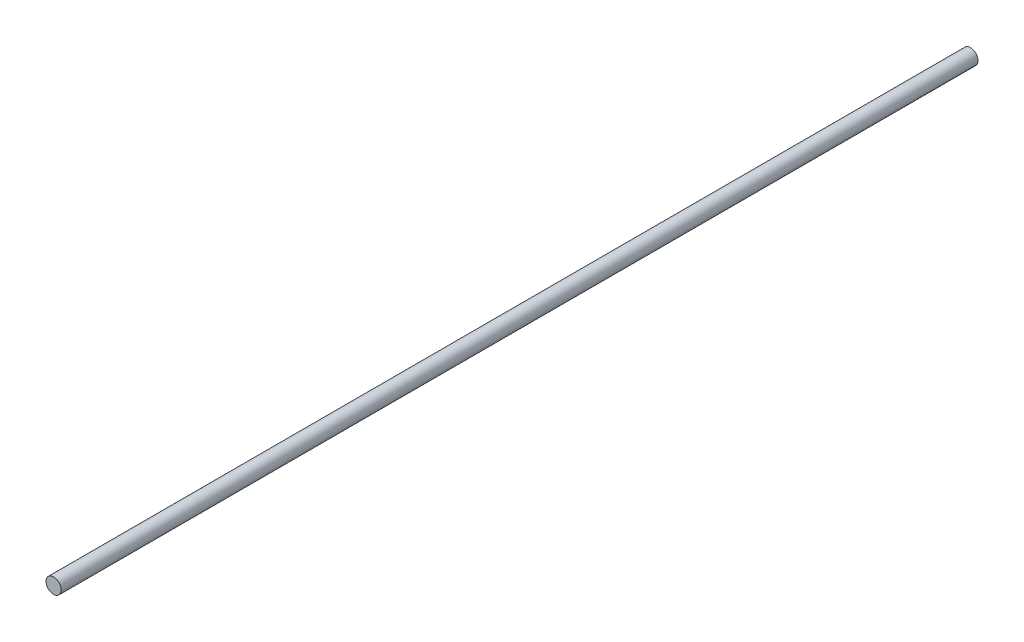
ISO-10303-21;
HEADER;
FILE_DESCRIPTION(('STEP AP214'),'2;1');
FILE_NAME('part.step','',(''),(''),'','','');
FILE_SCHEMA(('AUTOMOTIVE_DESIGN { 1 0 10303 214 1 1 1 1 }'));
ENDSEC;
DATA;
#1=APPLICATION_CONTEXT('core data for automotive mechanical design processes');
#2=APPLICATION_PROTOCOL_DEFINITION('international standard','automotive_design',2000,#1);
#3=PRODUCT_CONTEXT('',#1,'mechanical');
#4=PRODUCT('Part','Part','',(#3));
#5=PRODUCT_RELATED_PRODUCT_CATEGORY('part','',(#4));
#6=PRODUCT_DEFINITION_FORMATION('','',#4);
#7=PRODUCT_DEFINITION_CONTEXT('part definition',#1,'design');
#8=PRODUCT_DEFINITION('design','',#6,#7);
#9=PRODUCT_DEFINITION_SHAPE('','',#8);
#10=(LENGTH_UNIT() NAMED_UNIT(*) SI_UNIT(.MILLI.,.METRE.));
#11=(NAMED_UNIT(*) PLANE_ANGLE_UNIT() SI_UNIT($,.RADIAN.));
#12=(NAMED_UNIT(*) SI_UNIT($,.STERADIAN.) SOLID_ANGLE_UNIT());
#13=UNCERTAINTY_MEASURE_WITH_UNIT(LENGTH_MEASURE(1.E-05),#10,'distance_accuracy_value','');
#14=(GEOMETRIC_REPRESENTATION_CONTEXT(3) GLOBAL_UNCERTAINTY_ASSIGNED_CONTEXT((#13)) GLOBAL_UNIT_ASSIGNED_CONTEXT((#10,
#11,#12)) REPRESENTATION_CONTEXT('',''));
#15=CARTESIAN_POINT('',(0.,0.,0.));
#16=DIRECTION('',(0.,0.,1.));
#17=DIRECTION('',(1.,0.,0.));
#18=AXIS2_PLACEMENT_3D('',#15,#16,#17);
#19=CARTESIAN_POINT('',(0.,0.,12.1));
#20=DIRECTION('',(0.,0.,-1.));
#21=DIRECTION('',(-1.,0.,0.));
#22=AXIS2_PLACEMENT_3D('',#19,#20,#21);
#23=CYLINDRICAL_SURFACE('',#22,0.1);
#24=CARTESIAN_POINT('',(0.,0.,12.1));
#25=DIRECTION('',(0.,0.,1.));
#26=DIRECTION('',(1.,0.,0.));
#27=AXIS2_PLACEMENT_3D('',#24,#25,#26);
#28=CIRCLE('',#27,0.1);
#29=CARTESIAN_POINT('',(0.1,0.,12.1));
#30=VERTEX_POINT('',#29);
#31=EDGE_CURVE('E10',#30,#30,#28,.T.);
#32=ORIENTED_EDGE('',*,*,#31,.F.);
#33=EDGE_LOOP('',(#32));
#34=FACE_BOUND('',#33,.T.);
#35=CARTESIAN_POINT('',(0.,0.,0.));
#36=DIRECTION('',(0.,0.,1.));
#37=DIRECTION('',(1.,0.,0.));
#38=AXIS2_PLACEMENT_3D('',#35,#36,#37);
#39=CIRCLE('',#38,0.1);
#40=CARTESIAN_POINT('',(0.1,0.,0.));
#41=VERTEX_POINT('',#40);
#42=EDGE_CURVE('E38',#41,#41,#39,.T.);
#43=ORIENTED_EDGE('',*,*,#42,.T.);
#44=EDGE_LOOP('',(#43));
#45=FACE_BOUND('',#44,.T.);
#46=ADVANCED_FACE('F35',(#34,#45),#23,.T.);
#47=CARTESIAN_POINT('',(0.,0.,12.1));
#48=DIRECTION('',(0.,0.,1.));
#49=DIRECTION('',(1.,0.,0.));
#50=AXIS2_PLACEMENT_3D('',#47,#48,#49);
#51=PLANE('',#50);
#52=ORIENTED_EDGE('',*,*,#31,.T.);
#53=EDGE_LOOP('',(#52));
#54=FACE_BOUND('',#53,.T.);
#55=ADVANCED_FACE('F50',(#54),#51,.T.);
#56=CARTESIAN_POINT('',(0.,0.,0.));
#57=DIRECTION('',(0.,0.,1.));
#58=DIRECTION('',(1.,0.,0.));
#59=AXIS2_PLACEMENT_3D('',#56,#57,#58);
#60=PLANE('',#59);
#61=ORIENTED_EDGE('',*,*,#42,.F.);
#62=EDGE_LOOP('',(#61));
#63=FACE_BOUND('',#62,.T.);
#64=ADVANCED_FACE('F48',(#63),#60,.F.);
#65=CLOSED_SHELL('',(#46,#55,#64));
#66=MANIFOLD_SOLID_BREP('B2',#65);
#67=ADVANCED_BREP_SHAPE_REPRESENTATION('',(#18,#66),#14);
#68=SHAPE_DEFINITION_REPRESENTATION(#9,#67);
ENDSEC;
END-ISO-10303-21;
